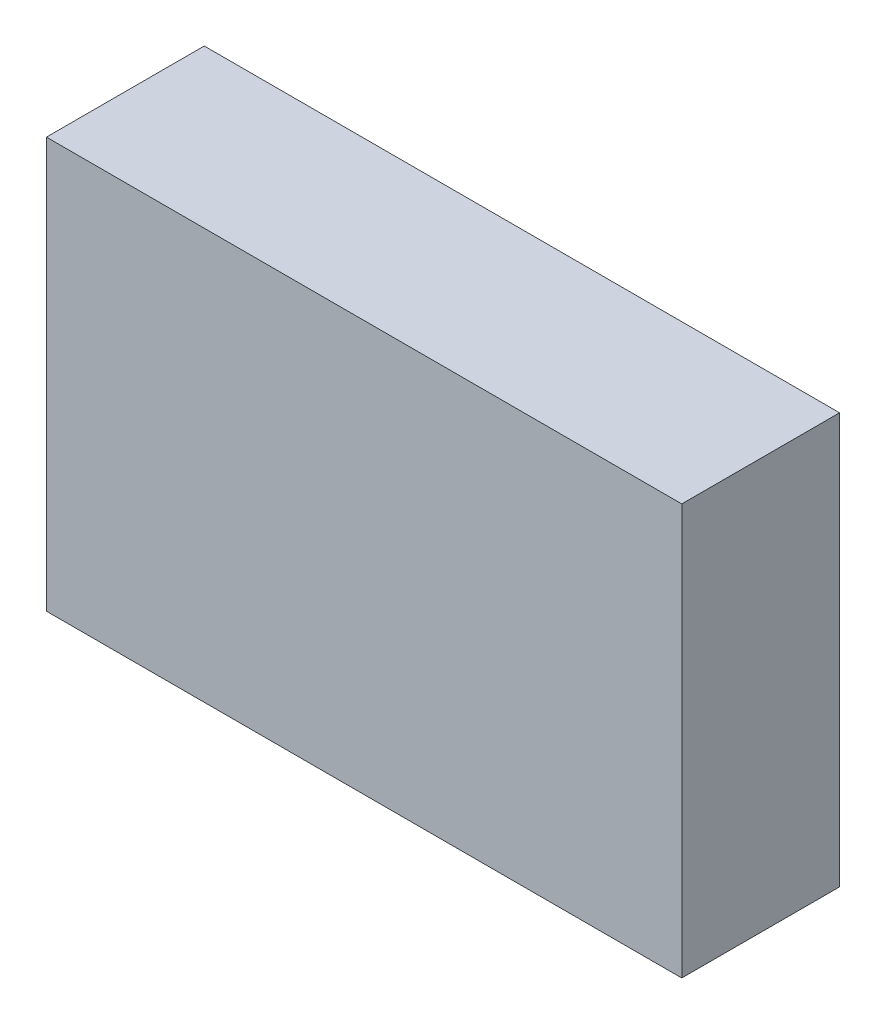
ISO-10303-21;
HEADER;
FILE_DESCRIPTION(('STEP AP214'),'2;1');
FILE_NAME('part.step','',(''),(''),'','','');
FILE_SCHEMA(('AUTOMOTIVE_DESIGN { 1 0 10303 214 1 1 1 1 }'));
ENDSEC;
DATA;
#1=APPLICATION_CONTEXT('core data for automotive mechanical design processes');
#2=APPLICATION_PROTOCOL_DEFINITION('international standard','automotive_design',2000,#1);
#3=PRODUCT_CONTEXT('',#1,'mechanical');
#4=PRODUCT('Part','Part','',(#3));
#5=PRODUCT_RELATED_PRODUCT_CATEGORY('part','',(#4));
#6=PRODUCT_DEFINITION_FORMATION('','',#4);
#7=PRODUCT_DEFINITION_CONTEXT('part definition',#1,'design');
#8=PRODUCT_DEFINITION('design','',#6,#7);
#9=PRODUCT_DEFINITION_SHAPE('','',#8);
#10=(LENGTH_UNIT() NAMED_UNIT(*) SI_UNIT(.MILLI.,.METRE.));
#11=(NAMED_UNIT(*) PLANE_ANGLE_UNIT() SI_UNIT($,.RADIAN.));
#12=(NAMED_UNIT(*) SI_UNIT($,.STERADIAN.) SOLID_ANGLE_UNIT());
#13=UNCERTAINTY_MEASURE_WITH_UNIT(LENGTH_MEASURE(1.E-05),#10,'distance_accuracy_value','');
#14=(GEOMETRIC_REPRESENTATION_CONTEXT(3) GLOBAL_UNCERTAINTY_ASSIGNED_CONTEXT((#13)) GLOBAL_UNIT_ASSIGNED_CONTEXT((#10,
#11,#12)) REPRESENTATION_CONTEXT('',''));
#15=CARTESIAN_POINT('',(0.,0.,0.));
#16=DIRECTION('',(0.,0.,1.));
#17=DIRECTION('',(1.,0.,0.));
#18=AXIS2_PLACEMENT_3D('',#15,#16,#17);
#19=CARTESIAN_POINT('',(-31.,-21.8727020539475,15.4));
#20=DIRECTION('',(1.,0.,0.));
#21=DIRECTION('',(0.,0.,-1.));
#22=AXIS2_PLACEMENT_3D('',#19,#20,#21);
#23=PLANE('',#22);
#24=DIRECTION('',(0.,-1.,0.));
#25=VECTOR('',#24,1.);
#26=CARTESIAN_POINT('',(-31.,-21.8727020539475,0.));
#27=LINE('',#26,#25);
#28=CARTESIAN_POINT('',(-31.,18.1958740600212,0.));
#29=VERTEX_POINT('',#28);
#30=CARTESIAN_POINT('',(-31.,-21.8727020539475,0.));
#31=VERTEX_POINT('',#30);
#32=EDGE_CURVE('E96',#29,#31,#27,.T.);
#33=ORIENTED_EDGE('',*,*,#32,.T.);
#34=DIRECTION('',(0.,0.,-1.));
#35=VECTOR('',#34,1.);
#36=CARTESIAN_POINT('',(-31.,-21.8727020539475,15.4));
#37=LINE('',#36,#35);
#38=CARTESIAN_POINT('',(-31.,-21.8727020539475,15.4));
#39=VERTEX_POINT('',#38);
#40=EDGE_CURVE('E11',#39,#31,#37,.T.);
#41=ORIENTED_EDGE('',*,*,#40,.F.);
#42=DIRECTION('',(0.,-1.,0.));
#43=VECTOR('',#42,1.);
#44=CARTESIAN_POINT('',(-31.,-21.8727020539475,15.4));
#45=LINE('',#44,#43);
#46=CARTESIAN_POINT('',(-31.,18.1958740600212,15.4));
#47=VERTEX_POINT('',#46);
#48=EDGE_CURVE('E84',#47,#39,#45,.T.);
#49=ORIENTED_EDGE('',*,*,#48,.F.);
#50=DIRECTION('',(0.,0.,-1.));
#51=VECTOR('',#50,1.);
#52=CARTESIAN_POINT('',(-31.,18.1958740600212,15.4));
#53=LINE('',#52,#51);
#54=EDGE_CURVE('E92',#47,#29,#53,.T.);
#55=ORIENTED_EDGE('',*,*,#54,.T.);
#56=EDGE_LOOP('',(#33,#41,#49,#55));
#57=FACE_BOUND('',#56,.T.);
#58=ADVANCED_FACE('F33',(#57),#23,.F.);
#59=CARTESIAN_POINT('',(31.,-21.8727020539475,15.4));
#60=DIRECTION('',(0.,1.,0.));
#61=DIRECTION('',(0.,0.,1.));
#62=AXIS2_PLACEMENT_3D('',#59,#60,#61);
#63=PLANE('',#62);
#64=DIRECTION('',(1.,0.,0.));
#65=VECTOR('',#64,1.);
#66=CARTESIAN_POINT('',(31.,-21.8727020539475,0.));
#67=LINE('',#66,#65);
#68=CARTESIAN_POINT('',(31.,-21.8727020539475,0.));
#69=VERTEX_POINT('',#68);
#70=EDGE_CURVE('E88',#31,#69,#67,.T.);
#71=ORIENTED_EDGE('',*,*,#70,.T.);
#72=DIRECTION('',(0.,0.,-1.));
#73=VECTOR('',#72,1.);
#74=CARTESIAN_POINT('',(31.,-21.8727020539475,15.4));
#75=LINE('',#74,#73);
#76=CARTESIAN_POINT('',(31.,-21.8727020539475,15.4));
#77=VERTEX_POINT('',#76);
#78=EDGE_CURVE('E41',#77,#69,#75,.T.);
#79=ORIENTED_EDGE('',*,*,#78,.F.);
#80=DIRECTION('',(1.,0.,0.));
#81=VECTOR('',#80,1.);
#82=CARTESIAN_POINT('',(31.,-21.8727020539475,15.4));
#83=LINE('',#82,#81);
#84=EDGE_CURVE('E79',#39,#77,#83,.T.);
#85=ORIENTED_EDGE('',*,*,#84,.F.);
#86=ORIENTED_EDGE('',*,*,#40,.T.);
#87=EDGE_LOOP('',(#71,#79,#85,#86));
#88=FACE_BOUND('',#87,.T.);
#89=ADVANCED_FACE('F87',(#88),#63,.F.);
#90=CARTESIAN_POINT('',(31.,-21.8727020539475,15.4));
#91=DIRECTION('',(-1.,0.,0.));
#92=DIRECTION('',(0.,0.,1.));
#93=AXIS2_PLACEMENT_3D('',#90,#91,#92);
#94=PLANE('',#93);
#95=DIRECTION('',(0.,1.,0.));
#96=VECTOR('',#95,1.);
#97=CARTESIAN_POINT('',(31.,-21.8727020539475,0.));
#98=LINE('',#97,#96);
#99=CARTESIAN_POINT('',(31.,18.1958740600212,0.));
#100=VERTEX_POINT('',#99);
#101=EDGE_CURVE('E66',#69,#100,#98,.T.);
#102=ORIENTED_EDGE('',*,*,#101,.T.);
#103=DIRECTION('',(0.,0.,-1.));
#104=VECTOR('',#103,1.);
#105=CARTESIAN_POINT('',(31.,18.1958740600212,15.4));
#106=LINE('',#105,#104);
#107=CARTESIAN_POINT('',(31.,18.1958740600212,15.4));
#108=VERTEX_POINT('',#107);
#109=EDGE_CURVE('E89',#108,#100,#106,.T.);
#110=ORIENTED_EDGE('',*,*,#109,.F.);
#111=DIRECTION('',(0.,1.,0.));
#112=VECTOR('',#111,1.);
#113=CARTESIAN_POINT('',(31.,-21.8727020539475,15.4));
#114=LINE('',#113,#112);
#115=EDGE_CURVE('E82',#77,#108,#114,.T.);
#116=ORIENTED_EDGE('',*,*,#115,.F.);
#117=ORIENTED_EDGE('',*,*,#78,.T.);
#118=EDGE_LOOP('',(#102,#110,#116,#117));
#119=FACE_BOUND('',#118,.T.);
#120=ADVANCED_FACE('F90',(#119),#94,.F.);
#121=CARTESIAN_POINT('',(31.,18.1958740600212,15.4));
#122=DIRECTION('',(0.,-1.,0.));
#123=DIRECTION('',(1.,0.,0.));
#124=AXIS2_PLACEMENT_3D('',#121,#122,#123);
#125=PLANE('',#124);
#126=DIRECTION('',(-1.,0.,0.));
#127=VECTOR('',#126,1.);
#128=CARTESIAN_POINT('',(31.,18.1958740600212,0.));
#129=LINE('',#128,#127);
#130=EDGE_CURVE('E72',#100,#29,#129,.T.);
#131=ORIENTED_EDGE('',*,*,#130,.T.);
#132=ORIENTED_EDGE('',*,*,#54,.F.);
#133=DIRECTION('',(-1.,0.,0.));
#134=VECTOR('',#133,1.);
#135=CARTESIAN_POINT('',(31.,18.1958740600212,15.4));
#136=LINE('',#135,#134);
#137=EDGE_CURVE('E49',#108,#47,#136,.T.);
#138=ORIENTED_EDGE('',*,*,#137,.F.);
#139=ORIENTED_EDGE('',*,*,#109,.T.);
#140=EDGE_LOOP('',(#131,#132,#138,#139));
#141=FACE_BOUND('',#140,.T.);
#142=ADVANCED_FACE('F103',(#141),#125,.F.);
#143=CARTESIAN_POINT('',(-31.,18.1958740600212,15.4));
#144=DIRECTION('',(0.,0.,1.));
#145=DIRECTION('',(1.,0.,0.));
#146=AXIS2_PLACEMENT_3D('',#143,#144,#145);
#147=PLANE('',#146);
#148=ORIENTED_EDGE('',*,*,#48,.T.);
#149=ORIENTED_EDGE('',*,*,#84,.T.);
#150=ORIENTED_EDGE('',*,*,#115,.T.);
#151=ORIENTED_EDGE('',*,*,#137,.T.);
#152=EDGE_LOOP('',(#148,#149,#150,#151));
#153=FACE_BOUND('',#152,.T.);
#154=ADVANCED_FACE('F80',(#153),#147,.T.);
#155=CARTESIAN_POINT('',(-31.,18.1958740600212,0.));
#156=DIRECTION('',(0.,0.,1.));
#157=DIRECTION('',(1.,0.,0.));
#158=AXIS2_PLACEMENT_3D('',#155,#156,#157);
#159=PLANE('',#158);
#160=ORIENTED_EDGE('',*,*,#32,.F.);
#161=ORIENTED_EDGE('',*,*,#130,.F.);
#162=ORIENTED_EDGE('',*,*,#101,.F.);
#163=ORIENTED_EDGE('',*,*,#70,.F.);
#164=EDGE_LOOP('',(#160,#161,#162,#163));
#165=FACE_BOUND('',#164,.T.);
#166=ADVANCED_FACE('F106',(#165),#159,.F.);
#167=CLOSED_SHELL('',(#58,#89,#120,#142,#154,#166));
#168=MANIFOLD_SOLID_BREP('B2',#167);
#169=ADVANCED_BREP_SHAPE_REPRESENTATION('',(#18,#168),#14);
#170=SHAPE_DEFINITION_REPRESENTATION(#9,#169);
ENDSEC;
END-ISO-10303-21;
